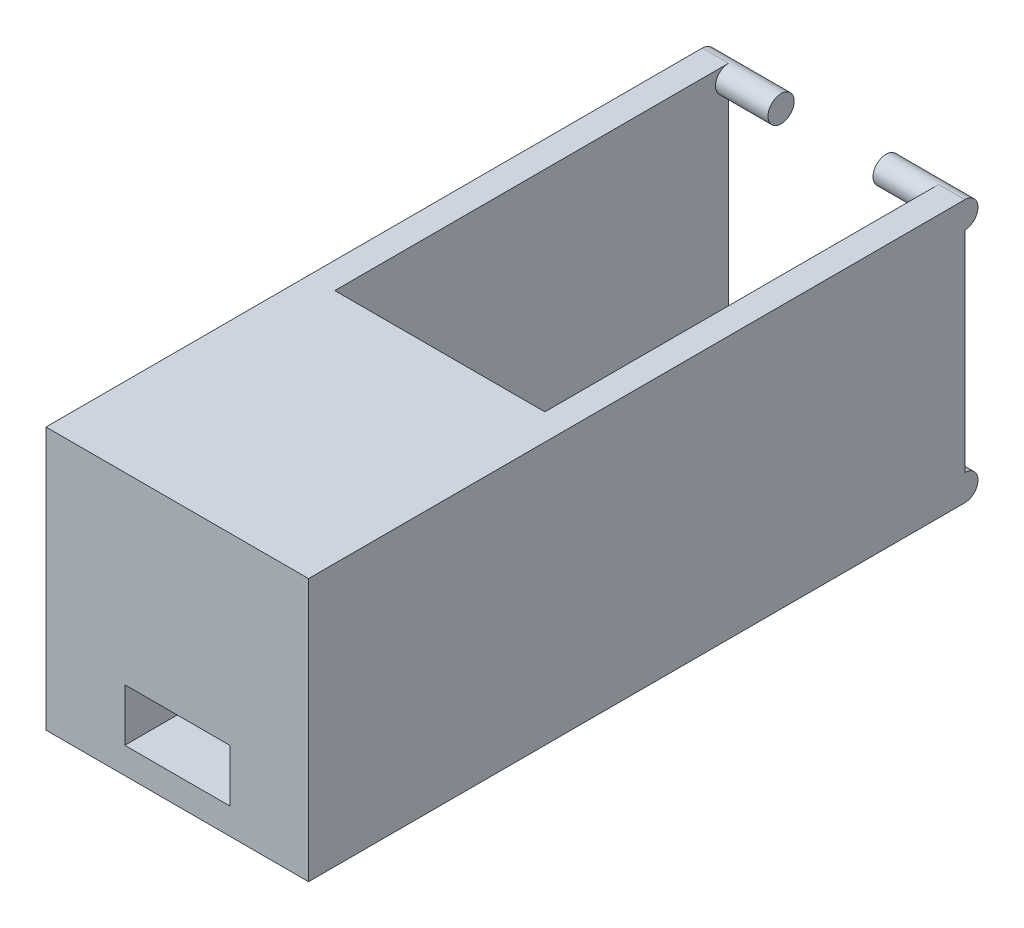
ISO-10303-21;
HEADER;
FILE_DESCRIPTION(('STEP AP214'),'2;1');
FILE_NAME('part.step','',(''),(''),'','','');
FILE_SCHEMA(('AUTOMOTIVE_DESIGN { 1 0 10303 214 1 1 1 1 }'));
ENDSEC;
DATA;
#1=APPLICATION_CONTEXT('core data for automotive mechanical design processes');
#2=APPLICATION_PROTOCOL_DEFINITION('international standard','automotive_design',2000,#1);
#3=PRODUCT_CONTEXT('',#1,'mechanical');
#4=PRODUCT('Part','Part','',(#3));
#5=PRODUCT_RELATED_PRODUCT_CATEGORY('part','',(#4));
#6=PRODUCT_DEFINITION_FORMATION('','',#4);
#7=PRODUCT_DEFINITION_CONTEXT('part definition',#1,'design');
#8=PRODUCT_DEFINITION('design','',#6,#7);
#9=PRODUCT_DEFINITION_SHAPE('','',#8);
#10=(LENGTH_UNIT() NAMED_UNIT(*) SI_UNIT(.MILLI.,.METRE.));
#11=(NAMED_UNIT(*) PLANE_ANGLE_UNIT() SI_UNIT($,.RADIAN.));
#12=(NAMED_UNIT(*) SI_UNIT($,.STERADIAN.) SOLID_ANGLE_UNIT());
#13=UNCERTAINTY_MEASURE_WITH_UNIT(LENGTH_MEASURE(1.E-05),#10,'distance_accuracy_value','');
#14=(GEOMETRIC_REPRESENTATION_CONTEXT(3) GLOBAL_UNCERTAINTY_ASSIGNED_CONTEXT((#13)) GLOBAL_UNIT_ASSIGNED_CONTEXT((#10,
#11,#12)) REPRESENTATION_CONTEXT('',''));
#15=CARTESIAN_POINT('',(0.,0.,0.));
#16=DIRECTION('',(0.,0.,1.));
#17=DIRECTION('',(1.,0.,0.));
#18=AXIS2_PLACEMENT_3D('',#15,#16,#17);
#19=CARTESIAN_POINT('',(-10.,20.,-30.));
#20=DIRECTION('',(0.,0.,1.));
#21=DIRECTION('',(1.,0.,0.));
#22=AXIS2_PLACEMENT_3D('',#19,#20,#21);
#23=PLANE('',#22);
#24=DIRECTION('',(0.,-1.,0.));
#25=VECTOR('',#24,1.);
#26=CARTESIAN_POINT('',(-10.,20.,-30.));
#27=LINE('',#26,#25);
#28=CARTESIAN_POINT('',(-10.,18.,-30.));
#29=VERTEX_POINT('',#28);
#30=CARTESIAN_POINT('',(-10.,2.,-30.));
#31=VERTEX_POINT('',#30);
#32=EDGE_CURVE('E236',#29,#31,#27,.T.);
#33=ORIENTED_EDGE('',*,*,#32,.F.);
#34=DIRECTION('',(1.,0.,0.));
#35=VECTOR('',#34,1.);
#36=CARTESIAN_POINT('',(-10.,18.,-30.));
#37=LINE('',#36,#35);
#38=CARTESIAN_POINT('',(-8.00000000000001,18.,-30.));
#39=VERTEX_POINT('',#38);
#40=EDGE_CURVE('E281',#29,#39,#37,.T.);
#41=ORIENTED_EDGE('',*,*,#40,.T.);
#42=DIRECTION('',(0.,1.,0.));
#43=VECTOR('',#42,1.);
#44=CARTESIAN_POINT('',(-8.00000000000001,2.,-30.));
#45=LINE('',#44,#43);
#46=CARTESIAN_POINT('',(-8.00000000000001,2.,-30.));
#47=VERTEX_POINT('',#46);
#48=EDGE_CURVE('E213',#47,#39,#45,.T.);
#49=ORIENTED_EDGE('',*,*,#48,.F.);
#50=DIRECTION('',(1.,0.,0.));
#51=VECTOR('',#50,1.);
#52=CARTESIAN_POINT('',(-10.,2.,-30.));
#53=LINE('',#52,#51);
#54=EDGE_CURVE('E280',#47,#31,#53,.F.);
#55=ORIENTED_EDGE('',*,*,#54,.T.);
#56=EDGE_LOOP('',(#33,#41,#49,#55));
#57=FACE_BOUND('',#56,.T.);
#58=ADVANCED_FACE('F34',(#57),#23,.F.);
#59=CARTESIAN_POINT('',(-10.,20.,-30.));
#60=DIRECTION('',(1.,0.,0.));
#61=DIRECTION('',(0.,0.,-1.));
#62=AXIS2_PLACEMENT_3D('',#59,#60,#61);
#63=PLANE('',#62);
#64=DIRECTION('',(0.,0.,1.));
#65=VECTOR('',#64,1.);
#66=CARTESIAN_POINT('',(-10.,20.,-30.));
#67=LINE('',#66,#65);
#68=CARTESIAN_POINT('',(-10.,20.,-30.));
#69=VERTEX_POINT('',#68);
#70=CARTESIAN_POINT('',(-10.,20.,20.));
#71=VERTEX_POINT('',#70);
#72=EDGE_CURVE('E223',#69,#71,#67,.T.);
#73=ORIENTED_EDGE('',*,*,#72,.F.);
#74=CARTESIAN_POINT('',(-10.,19.,-30.));
#75=DIRECTION('',(1.,0.,0.));
#76=DIRECTION('',(0.,0.,-1.));
#77=AXIS2_PLACEMENT_3D('',#74,#75,#76);
#78=CIRCLE('',#77,0.999999999999998);
#79=EDGE_CURVE('E284',#29,#69,#78,.T.);
#80=ORIENTED_EDGE('',*,*,#79,.F.);
#81=ORIENTED_EDGE('',*,*,#32,.T.);
#82=CARTESIAN_POINT('',(-10.,1.,-30.));
#83=DIRECTION('',(1.,0.,0.));
#84=DIRECTION('',(0.,0.,-1.));
#85=AXIS2_PLACEMENT_3D('',#82,#83,#84);
#86=CIRCLE('',#85,0.999999999999998);
#87=CARTESIAN_POINT('',(-10.,0.,-30.));
#88=VERTEX_POINT('',#87);
#89=EDGE_CURVE('E287',#88,#31,#86,.T.);
#90=ORIENTED_EDGE('',*,*,#89,.F.);
#91=DIRECTION('',(0.,0.,1.));
#92=VECTOR('',#91,1.);
#93=CARTESIAN_POINT('',(-10.,0.,-30.));
#94=LINE('',#93,#92);
#95=CARTESIAN_POINT('',(-10.,0.,20.));
#96=VERTEX_POINT('',#95);
#97=EDGE_CURVE('E216',#88,#96,#94,.T.);
#98=ORIENTED_EDGE('',*,*,#97,.T.);
#99=DIRECTION('',(0.,-1.,0.));
#100=VECTOR('',#99,1.);
#101=CARTESIAN_POINT('',(-10.,20.,20.));
#102=LINE('',#101,#100);
#103=EDGE_CURVE('E252',#71,#96,#102,.T.);
#104=ORIENTED_EDGE('',*,*,#103,.F.);
#105=EDGE_LOOP('',(#73,#80,#81,#90,#98,#104));
#106=FACE_BOUND('',#105,.T.);
#107=ADVANCED_FACE('F36',(#106),#63,.F.);
#108=CARTESIAN_POINT('',(-10.,20.,20.));
#109=DIRECTION('',(0.,0.,-1.));
#110=DIRECTION('',(-1.,0.,0.));
#111=AXIS2_PLACEMENT_3D('',#108,#109,#110);
#112=PLANE('',#111);
#113=DIRECTION('',(1.,0.,0.));
#114=VECTOR('',#113,1.);
#115=CARTESIAN_POINT('',(-10.,6.,20.));
#116=LINE('',#115,#114);
#117=CARTESIAN_POINT('',(-4.,6.,20.));
#118=VERTEX_POINT('',#117);
#119=CARTESIAN_POINT('',(4.,6.,20.));
#120=VERTEX_POINT('',#119);
#121=EDGE_CURVE('E395',#118,#120,#116,.T.);
#122=ORIENTED_EDGE('',*,*,#121,.T.);
#123=DIRECTION('',(0.,-1.,0.));
#124=VECTOR('',#123,1.);
#125=CARTESIAN_POINT('',(4.,20.,20.));
#126=LINE('',#125,#124);
#127=CARTESIAN_POINT('',(4.,2.,20.));
#128=VERTEX_POINT('',#127);
#129=EDGE_CURVE('E396',#120,#128,#126,.T.);
#130=ORIENTED_EDGE('',*,*,#129,.T.);
#131=DIRECTION('',(-1.,0.,0.));
#132=VECTOR('',#131,1.);
#133=CARTESIAN_POINT('',(-10.,2.,20.));
#134=LINE('',#133,#132);
#135=CARTESIAN_POINT('',(-4.,2.,20.));
#136=VERTEX_POINT('',#135);
#137=EDGE_CURVE('E401',#128,#136,#134,.T.);
#138=ORIENTED_EDGE('',*,*,#137,.T.);
#139=DIRECTION('',(0.,1.,0.));
#140=VECTOR('',#139,1.);
#141=CARTESIAN_POINT('',(-4.,20.,20.));
#142=LINE('',#141,#140);
#143=EDGE_CURVE('E171',#136,#118,#142,.T.);
#144=ORIENTED_EDGE('',*,*,#143,.T.);
#145=EDGE_LOOP('',(#122,#130,#138,#144));
#146=FACE_BOUND('',#145,.T.);
#147=DIRECTION('',(1.,0.,0.));
#148=VECTOR('',#147,1.);
#149=CARTESIAN_POINT('',(-10.,0.,20.));
#150=LINE('',#149,#148);
#151=CARTESIAN_POINT('',(10.,0.,20.));
#152=VERTEX_POINT('',#151);
#153=EDGE_CURVE('E239',#96,#152,#150,.T.);
#154=ORIENTED_EDGE('',*,*,#153,.T.);
#155=DIRECTION('',(0.,-1.,0.));
#156=VECTOR('',#155,1.);
#157=CARTESIAN_POINT('',(10.,20.,20.));
#158=LINE('',#157,#156);
#159=CARTESIAN_POINT('',(10.,20.,20.));
#160=VERTEX_POINT('',#159);
#161=EDGE_CURVE('E249',#160,#152,#158,.T.);
#162=ORIENTED_EDGE('',*,*,#161,.F.);
#163=DIRECTION('',(1.,0.,0.));
#164=VECTOR('',#163,1.);
#165=CARTESIAN_POINT('',(-10.,20.,20.));
#166=LINE('',#165,#164);
#167=EDGE_CURVE('E226',#71,#160,#166,.T.);
#168=ORIENTED_EDGE('',*,*,#167,.F.);
#169=ORIENTED_EDGE('',*,*,#103,.T.);
#170=EDGE_LOOP('',(#154,#162,#168,#169));
#171=FACE_BOUND('',#170,.T.);
#172=ADVANCED_FACE('F358',(#146,#171),#112,.F.);
#173=CARTESIAN_POINT('',(10.,20.,-30.));
#174=DIRECTION('',(-1.,0.,0.));
#175=DIRECTION('',(0.,0.,1.));
#176=AXIS2_PLACEMENT_3D('',#173,#174,#175);
#177=PLANE('',#176);
#178=DIRECTION('',(0.,-1.,0.));
#179=VECTOR('',#178,1.);
#180=CARTESIAN_POINT('',(10.,20.,-30.));
#181=LINE('',#180,#179);
#182=CARTESIAN_POINT('',(10.,18.,-30.));
#183=VERTEX_POINT('',#182);
#184=CARTESIAN_POINT('',(10.,2.,-30.));
#185=VERTEX_POINT('',#184);
#186=EDGE_CURVE('E247',#183,#185,#181,.T.);
#187=ORIENTED_EDGE('',*,*,#186,.F.);
#188=CARTESIAN_POINT('',(10.,19.,-30.));
#189=DIRECTION('',(-1.,0.,0.));
#190=DIRECTION('',(0.,0.,1.));
#191=AXIS2_PLACEMENT_3D('',#188,#189,#190);
#192=CIRCLE('',#191,0.999999999999998);
#193=CARTESIAN_POINT('',(10.,20.,-30.));
#194=VERTEX_POINT('',#193);
#195=EDGE_CURVE('E344',#194,#183,#192,.T.);
#196=ORIENTED_EDGE('',*,*,#195,.F.);
#197=DIRECTION('',(0.,0.,-1.));
#198=VECTOR('',#197,1.);
#199=CARTESIAN_POINT('',(10.,20.,-30.));
#200=LINE('',#199,#198);
#201=EDGE_CURVE('E229',#160,#194,#200,.T.);
#202=ORIENTED_EDGE('',*,*,#201,.F.);
#203=ORIENTED_EDGE('',*,*,#161,.T.);
#204=DIRECTION('',(0.,0.,-1.));
#205=VECTOR('',#204,1.);
#206=CARTESIAN_POINT('',(10.,0.,-30.));
#207=LINE('',#206,#205);
#208=CARTESIAN_POINT('',(10.,0.,-30.));
#209=VERTEX_POINT('',#208);
#210=EDGE_CURVE('E241',#152,#209,#207,.T.);
#211=ORIENTED_EDGE('',*,*,#210,.T.);
#212=CARTESIAN_POINT('',(10.,1.,-30.));
#213=DIRECTION('',(-1.,0.,0.));
#214=DIRECTION('',(0.,0.,1.));
#215=AXIS2_PLACEMENT_3D('',#212,#213,#214);
#216=CIRCLE('',#215,0.999999999999998);
#217=EDGE_CURVE('E336',#185,#209,#216,.T.);
#218=ORIENTED_EDGE('',*,*,#217,.F.);
#219=EDGE_LOOP('',(#187,#196,#202,#203,#211,#218));
#220=FACE_BOUND('',#219,.T.);
#221=ADVANCED_FACE('F353',(#220),#177,.F.);
#222=DIRECTION('',(0.,1.,0.));
#223=VECTOR('',#222,1.);
#224=CARTESIAN_POINT('',(8.,2.,-30.));
#225=LINE('',#224,#223);
#226=CARTESIAN_POINT('',(8.,2.,-30.));
#227=VERTEX_POINT('',#226);
#228=CARTESIAN_POINT('',(8.,18.,-30.));
#229=VERTEX_POINT('',#228);
#230=EDGE_CURVE('E217',#227,#229,#225,.T.);
#231=ORIENTED_EDGE('',*,*,#230,.T.);
#232=DIRECTION('',(-1.,0.,0.));
#233=VECTOR('',#232,1.);
#234=CARTESIAN_POINT('',(10.,18.,-30.));
#235=LINE('',#234,#233);
#236=EDGE_CURVE('E343',#229,#183,#235,.F.);
#237=ORIENTED_EDGE('',*,*,#236,.T.);
#238=ORIENTED_EDGE('',*,*,#186,.T.);
#239=DIRECTION('',(-1.,0.,0.));
#240=VECTOR('',#239,1.);
#241=CARTESIAN_POINT('',(10.,2.,-30.));
#242=LINE('',#241,#240);
#243=EDGE_CURVE('E329',#185,#227,#242,.T.);
#244=ORIENTED_EDGE('',*,*,#243,.T.);
#245=EDGE_LOOP('',(#231,#237,#238,#244));
#246=FACE_BOUND('',#245,.T.);
#247=ADVANCED_FACE('F333',(#246),#23,.F.);
#248=CARTESIAN_POINT('',(0.,20.,0.));
#249=DIRECTION('',(0.,1.,0.));
#250=DIRECTION('',(0.,0.,1.));
#251=AXIS2_PLACEMENT_3D('',#248,#249,#250);
#252=PLANE('',#251);
#253=DIRECTION('',(0.,0.,1.));
#254=VECTOR('',#253,1.);
#255=CARTESIAN_POINT('',(-8.00000000000001,20.,-30.));
#256=LINE('',#255,#254);
#257=CARTESIAN_POINT('',(-8.00000000000001,20.,-30.));
#258=VERTEX_POINT('',#257);
#259=CARTESIAN_POINT('',(-8.,20.,0.));
#260=VERTEX_POINT('',#259);
#261=EDGE_CURVE('E204',#258,#260,#256,.T.);
#262=ORIENTED_EDGE('',*,*,#261,.F.);
#263=DIRECTION('',(-1.,0.,0.));
#264=VECTOR('',#263,1.);
#265=CARTESIAN_POINT('',(-10.,20.,-30.));
#266=LINE('',#265,#264);
#267=EDGE_CURVE('E232',#258,#69,#266,.T.);
#268=ORIENTED_EDGE('',*,*,#267,.T.);
#269=ORIENTED_EDGE('',*,*,#72,.T.);
#270=ORIENTED_EDGE('',*,*,#167,.T.);
#271=ORIENTED_EDGE('',*,*,#201,.T.);
#272=CARTESIAN_POINT('',(8.,20.,-30.));
#273=VERTEX_POINT('',#272);
#274=EDGE_CURVE('E233',#194,#273,#266,.T.);
#275=ORIENTED_EDGE('',*,*,#274,.T.);
#276=DIRECTION('',(0.,0.,-1.));
#277=VECTOR('',#276,1.);
#278=CARTESIAN_POINT('',(8.,20.,-30.));
#279=LINE('',#278,#277);
#280=CARTESIAN_POINT('',(8.,20.,0.));
#281=VERTEX_POINT('',#280);
#282=EDGE_CURVE('E210',#281,#273,#279,.T.);
#283=ORIENTED_EDGE('',*,*,#282,.F.);
#284=DIRECTION('',(1.,0.,0.));
#285=VECTOR('',#284,1.);
#286=CARTESIAN_POINT('',(-8.,20.,0.));
#287=LINE('',#286,#285);
#288=EDGE_CURVE('E206',#260,#281,#287,.T.);
#289=ORIENTED_EDGE('',*,*,#288,.F.);
#290=EDGE_LOOP('',(#262,#268,#269,#270,#271,#275,#283,#289));
#291=FACE_BOUND('',#290,.T.);
#292=ADVANCED_FACE('F272',(#291),#252,.T.);
#293=CARTESIAN_POINT('',(0.,0.,0.));
#294=DIRECTION('',(0.,1.,0.));
#295=DIRECTION('',(0.,0.,1.));
#296=AXIS2_PLACEMENT_3D('',#293,#294,#295);
#297=PLANE('',#296);
#298=DIRECTION('',(-1.,0.,0.));
#299=VECTOR('',#298,1.);
#300=CARTESIAN_POINT('',(-10.,0.,-30.));
#301=LINE('',#300,#299);
#302=CARTESIAN_POINT('',(-4.,0.,-30.));
#303=VERTEX_POINT('',#302);
#304=EDGE_CURVE('E244',#303,#88,#301,.T.);
#305=ORIENTED_EDGE('',*,*,#304,.F.);
#306=DIRECTION('',(0.,0.,-1.));
#307=VECTOR('',#306,1.);
#308=CARTESIAN_POINT('',(-4.,0.,-42.4027351839628));
#309=LINE('',#308,#307);
#310=CARTESIAN_POINT('',(-4.,0.,-4.));
#311=VERTEX_POINT('',#310);
#312=EDGE_CURVE('E296',#311,#303,#309,.T.);
#313=ORIENTED_EDGE('',*,*,#312,.F.);
#314=DIRECTION('',(-1.,0.,0.));
#315=VECTOR('',#314,1.);
#316=CARTESIAN_POINT('',(-4.,0.,-4.));
#317=LINE('',#316,#315);
#318=CARTESIAN_POINT('',(4.,0.,-4.));
#319=VERTEX_POINT('',#318);
#320=EDGE_CURVE('E302',#319,#311,#317,.T.);
#321=ORIENTED_EDGE('',*,*,#320,.F.);
#322=DIRECTION('',(0.,0.,1.));
#323=VECTOR('',#322,1.);
#324=CARTESIAN_POINT('',(4.,0.,-42.4027351839628));
#325=LINE('',#324,#323);
#326=CARTESIAN_POINT('',(4.,0.,-30.));
#327=VERTEX_POINT('',#326);
#328=EDGE_CURVE('E299',#327,#319,#325,.T.);
#329=ORIENTED_EDGE('',*,*,#328,.F.);
#330=EDGE_CURVE('E227',#209,#327,#301,.T.);
#331=ORIENTED_EDGE('',*,*,#330,.F.);
#332=ORIENTED_EDGE('',*,*,#210,.F.);
#333=ORIENTED_EDGE('',*,*,#153,.F.);
#334=ORIENTED_EDGE('',*,*,#97,.F.);
#335=EDGE_LOOP('',(#305,#313,#321,#329,#331,#332,#333,#334));
#336=FACE_BOUND('',#335,.T.);
#337=ADVANCED_FACE('F321',(#336),#297,.F.);
#338=CARTESIAN_POINT('',(-8.00000000000001,2.,-30.));
#339=DIRECTION('',(-1.,0.,0.));
#340=DIRECTION('',(0.,0.,1.));
#341=AXIS2_PLACEMENT_3D('',#338,#339,#340);
#342=PLANE('',#341);
#343=ORIENTED_EDGE('',*,*,#48,.T.);
#344=CARTESIAN_POINT('',(-8.00000000000001,19.,-30.));
#345=DIRECTION('',(-1.,0.,0.));
#346=DIRECTION('',(0.,0.,1.));
#347=AXIS2_PLACEMENT_3D('',#344,#345,#346);
#348=CIRCLE('',#347,0.999999999999998);
#349=EDGE_CURVE('E42',#39,#258,#348,.T.);
#350=ORIENTED_EDGE('',*,*,#349,.T.);
#351=ORIENTED_EDGE('',*,*,#261,.T.);
#352=DIRECTION('',(0.,1.,0.));
#353=VECTOR('',#352,1.);
#354=CARTESIAN_POINT('',(-8.,2.,0.));
#355=LINE('',#354,#353);
#356=CARTESIAN_POINT('',(-8.,2.,0.));
#357=VERTEX_POINT('',#356);
#358=EDGE_CURVE('E203',#357,#260,#355,.T.);
#359=ORIENTED_EDGE('',*,*,#358,.F.);
#360=DIRECTION('',(0.,0.,1.));
#361=VECTOR('',#360,1.);
#362=CARTESIAN_POINT('',(-8.00000000000001,2.,-30.));
#363=LINE('',#362,#361);
#364=EDGE_CURVE('E190',#47,#357,#363,.T.);
#365=ORIENTED_EDGE('',*,*,#364,.F.);
#366=EDGE_LOOP('',(#343,#350,#351,#359,#365));
#367=FACE_BOUND('',#366,.T.);
#368=ADVANCED_FACE('F265',(#367),#342,.F.);
#369=CARTESIAN_POINT('',(8.,2.,-30.));
#370=DIRECTION('',(1.,0.,0.));
#371=DIRECTION('',(0.,0.,-1.));
#372=AXIS2_PLACEMENT_3D('',#369,#370,#371);
#373=PLANE('',#372);
#374=ORIENTED_EDGE('',*,*,#282,.T.);
#375=CARTESIAN_POINT('',(8.,19.,-30.));
#376=DIRECTION('',(1.,0.,0.));
#377=DIRECTION('',(0.,0.,-1.));
#378=AXIS2_PLACEMENT_3D('',#375,#376,#377);
#379=CIRCLE('',#378,0.999999999999998);
#380=EDGE_CURVE('E11',#273,#229,#379,.T.);
#381=ORIENTED_EDGE('',*,*,#380,.T.);
#382=ORIENTED_EDGE('',*,*,#230,.F.);
#383=DIRECTION('',(0.,0.,-1.));
#384=VECTOR('',#383,1.);
#385=CARTESIAN_POINT('',(8.,2.,-30.));
#386=LINE('',#385,#384);
#387=CARTESIAN_POINT('',(8.,2.,0.));
#388=VERTEX_POINT('',#387);
#389=EDGE_CURVE('E191',#388,#227,#386,.T.);
#390=ORIENTED_EDGE('',*,*,#389,.F.);
#391=DIRECTION('',(0.,1.,0.));
#392=VECTOR('',#391,1.);
#393=CARTESIAN_POINT('',(8.,2.,0.));
#394=LINE('',#393,#392);
#395=EDGE_CURVE('E220',#388,#281,#394,.T.);
#396=ORIENTED_EDGE('',*,*,#395,.T.);
#397=EDGE_LOOP('',(#374,#381,#382,#390,#396));
#398=FACE_BOUND('',#397,.T.);
#399=ADVANCED_FACE('F339',(#398),#373,.F.);
#400=CARTESIAN_POINT('',(-8.,2.,0.));
#401=DIRECTION('',(0.,0.,1.));
#402=DIRECTION('',(1.,0.,0.));
#403=AXIS2_PLACEMENT_3D('',#400,#401,#402);
#404=PLANE('',#403);
#405=DIRECTION('',(1.,0.,0.));
#406=VECTOR('',#405,1.);
#407=CARTESIAN_POINT('',(-8.,2.,0.));
#408=LINE('',#407,#406);
#409=CARTESIAN_POINT('',(4.,2.,0.));
#410=VERTEX_POINT('',#409);
#411=EDGE_CURVE('E192',#410,#388,#408,.T.);
#412=ORIENTED_EDGE('',*,*,#411,.F.);
#413=DIRECTION('',(0.,-1.,0.));
#414=VECTOR('',#413,1.);
#415=CARTESIAN_POINT('',(4.,2.,0.));
#416=LINE('',#415,#414);
#417=CARTESIAN_POINT('',(4.,6.,0.));
#418=VERTEX_POINT('',#417);
#419=EDGE_CURVE('E57',#418,#410,#416,.T.);
#420=ORIENTED_EDGE('',*,*,#419,.F.);
#421=DIRECTION('',(1.,0.,0.));
#422=VECTOR('',#421,1.);
#423=CARTESIAN_POINT('',(4.,6.,0.));
#424=LINE('',#423,#422);
#425=CARTESIAN_POINT('',(-4.,6.,0.));
#426=VERTEX_POINT('',#425);
#427=EDGE_CURVE('E184',#426,#418,#424,.T.);
#428=ORIENTED_EDGE('',*,*,#427,.F.);
#429=DIRECTION('',(0.,1.,0.));
#430=VECTOR('',#429,1.);
#431=CARTESIAN_POINT('',(-4.,2.,0.));
#432=LINE('',#431,#430);
#433=CARTESIAN_POINT('',(-4.,2.,0.));
#434=VERTEX_POINT('',#433);
#435=EDGE_CURVE('E168',#434,#426,#432,.T.);
#436=ORIENTED_EDGE('',*,*,#435,.F.);
#437=EDGE_CURVE('E181',#357,#434,#408,.T.);
#438=ORIENTED_EDGE('',*,*,#437,.F.);
#439=ORIENTED_EDGE('',*,*,#358,.T.);
#440=ORIENTED_EDGE('',*,*,#288,.T.);
#441=ORIENTED_EDGE('',*,*,#395,.F.);
#442=EDGE_LOOP('',(#412,#420,#428,#436,#438,#439,#440,#441));
#443=FACE_BOUND('',#442,.T.);
#444=ADVANCED_FACE('F179',(#443),#404,.F.);
#445=CARTESIAN_POINT('',(0.,2.,0.));
#446=DIRECTION('',(0.,1.,0.));
#447=DIRECTION('',(0.,0.,1.));
#448=AXIS2_PLACEMENT_3D('',#445,#446,#447);
#449=PLANE('',#448);
#450=DIRECTION('',(0.,0.,1.));
#451=VECTOR('',#450,1.);
#452=CARTESIAN_POINT('',(-4.,2.,0.));
#453=LINE('',#452,#451);
#454=CARTESIAN_POINT('',(-4.,2.,-30.));
#455=VERTEX_POINT('',#454);
#456=CARTESIAN_POINT('',(-4.,2.,-4.));
#457=VERTEX_POINT('',#456);
#458=EDGE_CURVE('E261',#455,#457,#453,.T.);
#459=ORIENTED_EDGE('',*,*,#458,.F.);
#460=DIRECTION('',(-1.,0.,0.));
#461=VECTOR('',#460,1.);
#462=CARTESIAN_POINT('',(-8.00000000000001,2.,-30.));
#463=LINE('',#462,#461);
#464=EDGE_CURVE('E195',#455,#47,#463,.T.);
#465=ORIENTED_EDGE('',*,*,#464,.T.);
#466=ORIENTED_EDGE('',*,*,#364,.T.);
#467=ORIENTED_EDGE('',*,*,#437,.T.);
#468=DIRECTION('',(0.,0.,-1.));
#469=VECTOR('',#468,1.);
#470=CARTESIAN_POINT('',(-4.,2.,30.));
#471=LINE('',#470,#469);
#472=EDGE_CURVE('E49',#136,#434,#471,.T.);
#473=ORIENTED_EDGE('',*,*,#472,.F.);
#474=ORIENTED_EDGE('',*,*,#137,.F.);
#475=DIRECTION('',(0.,0.,-1.));
#476=VECTOR('',#475,1.);
#477=CARTESIAN_POINT('',(4.,2.,30.));
#478=LINE('',#477,#476);
#479=EDGE_CURVE('E174',#128,#410,#478,.T.);
#480=ORIENTED_EDGE('',*,*,#479,.T.);
#481=ORIENTED_EDGE('',*,*,#411,.T.);
#482=ORIENTED_EDGE('',*,*,#389,.T.);
#483=CARTESIAN_POINT('',(4.,2.,-30.));
#484=VERTEX_POINT('',#483);
#485=EDGE_CURVE('E200',#227,#484,#463,.T.);
#486=ORIENTED_EDGE('',*,*,#485,.T.);
#487=DIRECTION('',(0.,0.,-1.));
#488=VECTOR('',#487,1.);
#489=CARTESIAN_POINT('',(4.,2.,0.));
#490=LINE('',#489,#488);
#491=CARTESIAN_POINT('',(4.,2.,-4.));
#492=VERTEX_POINT('',#491);
#493=EDGE_CURVE('E255',#492,#484,#490,.T.);
#494=ORIENTED_EDGE('',*,*,#493,.F.);
#495=DIRECTION('',(1.,0.,0.));
#496=VECTOR('',#495,1.);
#497=CARTESIAN_POINT('',(0.,2.,-4.));
#498=LINE('',#497,#496);
#499=EDGE_CURVE('E258',#457,#492,#498,.T.);
#500=ORIENTED_EDGE('',*,*,#499,.F.);
#501=EDGE_LOOP('',(#459,#465,#466,#467,#473,#474,#480,#481,#482,#486,#494,#500));
#502=FACE_BOUND('',#501,.T.);
#503=ADVANCED_FACE('F187',(#502),#449,.T.);
#504=CARTESIAN_POINT('',(-4.,18.,-42.4027351839628));
#505=DIRECTION('',(-1.,0.,0.));
#506=DIRECTION('',(0.,0.,1.));
#507=AXIS2_PLACEMENT_3D('',#504,#505,#506);
#508=PLANE('',#507);
#509=ORIENTED_EDGE('',*,*,#312,.T.);
#510=CARTESIAN_POINT('',(-4.,1.,-30.));
#511=DIRECTION('',(1.,0.,0.));
#512=DIRECTION('',(0.,0.,-1.));
#513=AXIS2_PLACEMENT_3D('',#510,#511,#512);
#514=CIRCLE('',#513,0.999999999999998);
#515=EDGE_CURVE('E283',#303,#455,#514,.T.);
#516=ORIENTED_EDGE('',*,*,#515,.T.);
#517=ORIENTED_EDGE('',*,*,#458,.T.);
#518=DIRECTION('',(0.,-1.,0.));
#519=VECTOR('',#518,1.);
#520=CARTESIAN_POINT('',(-4.,18.,-4.));
#521=LINE('',#520,#519);
#522=EDGE_CURVE('E207',#457,#311,#521,.T.);
#523=ORIENTED_EDGE('',*,*,#522,.T.);
#524=EDGE_LOOP('',(#509,#516,#517,#523));
#525=FACE_BOUND('',#524,.T.);
#526=ADVANCED_FACE('F324',(#525),#508,.F.);
#527=CARTESIAN_POINT('',(4.,18.,-42.4027351839628));
#528=DIRECTION('',(1.,0.,0.));
#529=DIRECTION('',(0.,0.,-1.));
#530=AXIS2_PLACEMENT_3D('',#527,#528,#529);
#531=PLANE('',#530);
#532=ORIENTED_EDGE('',*,*,#493,.T.);
#533=CARTESIAN_POINT('',(4.,1.,-30.));
#534=DIRECTION('',(-1.,0.,0.));
#535=DIRECTION('',(0.,0.,1.));
#536=AXIS2_PLACEMENT_3D('',#533,#534,#535);
#537=CIRCLE('',#536,0.999999999999998);
#538=EDGE_CURVE('E317',#484,#327,#537,.T.);
#539=ORIENTED_EDGE('',*,*,#538,.T.);
#540=ORIENTED_EDGE('',*,*,#328,.T.);
#541=DIRECTION('',(0.,-1.,0.));
#542=VECTOR('',#541,1.);
#543=CARTESIAN_POINT('',(4.,18.,-4.));
#544=LINE('',#543,#542);
#545=EDGE_CURVE('E305',#492,#319,#544,.T.);
#546=ORIENTED_EDGE('',*,*,#545,.F.);
#547=EDGE_LOOP('',(#532,#539,#540,#546));
#548=FACE_BOUND('',#547,.T.);
#549=ADVANCED_FACE('F316',(#548),#531,.F.);
#550=CARTESIAN_POINT('',(-4.,18.,-4.));
#551=DIRECTION('',(0.,0.,1.));
#552=DIRECTION('',(1.,0.,0.));
#553=AXIS2_PLACEMENT_3D('',#550,#551,#552);
#554=PLANE('',#553);
#555=ORIENTED_EDGE('',*,*,#499,.T.);
#556=ORIENTED_EDGE('',*,*,#545,.T.);
#557=ORIENTED_EDGE('',*,*,#320,.T.);
#558=ORIENTED_EDGE('',*,*,#522,.F.);
#559=EDGE_LOOP('',(#555,#556,#557,#558));
#560=FACE_BOUND('',#559,.T.);
#561=ADVANCED_FACE('F307',(#560),#554,.F.);
#562=CARTESIAN_POINT('',(-10.,1.,-30.));
#563=DIRECTION('',(1.,0.,0.));
#564=DIRECTION('',(0.,0.,-1.));
#565=AXIS2_PLACEMENT_3D('',#562,#563,#564);
#566=CYLINDRICAL_SURFACE('',#565,0.999999999999998);
#567=ORIENTED_EDGE('',*,*,#304,.T.);
#568=ORIENTED_EDGE('',*,*,#89,.T.);
#569=ORIENTED_EDGE('',*,*,#54,.F.);
#570=ORIENTED_EDGE('',*,*,#464,.F.);
#571=ORIENTED_EDGE('',*,*,#515,.F.);
#572=EDGE_LOOP('',(#567,#568,#569,#570,#571));
#573=FACE_BOUND('',#572,.T.);
#574=ADVANCED_FACE('F362',(#573),#566,.T.);
#575=CARTESIAN_POINT('',(-10.,19.,-30.));
#576=DIRECTION('',(1.,0.,0.));
#577=DIRECTION('',(0.,0.,-1.));
#578=AXIS2_PLACEMENT_3D('',#575,#576,#577);
#579=CYLINDRICAL_SURFACE('',#578,0.999999999999998);
#580=CARTESIAN_POINT('',(-4.,19.,-30.));
#581=DIRECTION('',(1.,0.,0.));
#582=DIRECTION('',(0.,0.,-1.));
#583=AXIS2_PLACEMENT_3D('',#580,#581,#582);
#584=CIRCLE('',#583,0.999999999999998);
#585=CARTESIAN_POINT('',(-4.,19.,-31.));
#586=VERTEX_POINT('',#585);
#587=EDGE_CURVE('E289',#586,#586,#584,.T.);
#588=ORIENTED_EDGE('',*,*,#587,.F.);
#589=EDGE_LOOP('',(#588));
#590=FACE_BOUND('',#589,.T.);
#591=ORIENTED_EDGE('',*,*,#40,.F.);
#592=ORIENTED_EDGE('',*,*,#79,.T.);
#593=ORIENTED_EDGE('',*,*,#267,.F.);
#594=ORIENTED_EDGE('',*,*,#349,.F.);
#595=EDGE_LOOP('',(#591,#592,#593,#594));
#596=FACE_BOUND('',#595,.T.);
#597=ADVANCED_FACE('F364',(#590,#596),#579,.T.);
#598=CARTESIAN_POINT('',(-4.,19.,-30.));
#599=DIRECTION('',(1.,0.,0.));
#600=DIRECTION('',(0.,0.,-1.));
#601=AXIS2_PLACEMENT_3D('',#598,#599,#600);
#602=PLANE('',#601);
#603=ORIENTED_EDGE('',*,*,#587,.T.);
#604=EDGE_LOOP('',(#603));
#605=FACE_BOUND('',#604,.T.);
#606=ADVANCED_FACE('F370',(#605),#602,.T.);
#607=CARTESIAN_POINT('',(10.,1.,-30.));
#608=DIRECTION('',(-1.,0.,0.));
#609=DIRECTION('',(0.,0.,1.));
#610=AXIS2_PLACEMENT_3D('',#607,#608,#609);
#611=CYLINDRICAL_SURFACE('',#610,0.999999999999998);
#612=ORIENTED_EDGE('',*,*,#217,.T.);
#613=ORIENTED_EDGE('',*,*,#330,.T.);
#614=ORIENTED_EDGE('',*,*,#538,.F.);
#615=ORIENTED_EDGE('',*,*,#485,.F.);
#616=ORIENTED_EDGE('',*,*,#243,.F.);
#617=EDGE_LOOP('',(#612,#613,#614,#615,#616));
#618=FACE_BOUND('',#617,.T.);
#619=ADVANCED_FACE('F328',(#618),#611,.T.);
#620=CARTESIAN_POINT('',(10.,19.,-30.));
#621=DIRECTION('',(-1.,0.,0.));
#622=DIRECTION('',(0.,0.,1.));
#623=AXIS2_PLACEMENT_3D('',#620,#621,#622);
#624=CYLINDRICAL_SURFACE('',#623,0.999999999999998);
#625=CARTESIAN_POINT('',(4.,19.,-30.));
#626=DIRECTION('',(-1.,0.,0.));
#627=DIRECTION('',(0.,0.,1.));
#628=AXIS2_PLACEMENT_3D('',#625,#626,#627);
#629=CIRCLE('',#628,0.999999999999998);
#630=CARTESIAN_POINT('',(4.,19.,-29.));
#631=VERTEX_POINT('',#630);
#632=EDGE_CURVE('E347',#631,#631,#629,.T.);
#633=ORIENTED_EDGE('',*,*,#632,.F.);
#634=EDGE_LOOP('',(#633));
#635=FACE_BOUND('',#634,.T.);
#636=ORIENTED_EDGE('',*,*,#236,.F.);
#637=ORIENTED_EDGE('',*,*,#380,.F.);
#638=ORIENTED_EDGE('',*,*,#274,.F.);
#639=ORIENTED_EDGE('',*,*,#195,.T.);
#640=EDGE_LOOP('',(#636,#637,#638,#639));
#641=FACE_BOUND('',#640,.T.);
#642=ADVANCED_FACE('F341',(#635,#641),#624,.T.);
#643=CARTESIAN_POINT('',(4.,19.,-30.));
#644=DIRECTION('',(-1.,0.,0.));
#645=DIRECTION('',(0.,0.,1.));
#646=AXIS2_PLACEMENT_3D('',#643,#644,#645);
#647=PLANE('',#646);
#648=ORIENTED_EDGE('',*,*,#632,.T.);
#649=EDGE_LOOP('',(#648));
#650=FACE_BOUND('',#649,.T.);
#651=ADVANCED_FACE('F413',(#650),#647,.T.);
#652=CARTESIAN_POINT('',(4.,2.,30.));
#653=DIRECTION('',(1.,0.,0.));
#654=DIRECTION('',(0.,0.,-1.));
#655=AXIS2_PLACEMENT_3D('',#652,#653,#654);
#656=PLANE('',#655);
#657=DIRECTION('',(0.,0.,-1.));
#658=VECTOR('',#657,1.);
#659=CARTESIAN_POINT('',(4.,6.,30.));
#660=LINE('',#659,#658);
#661=EDGE_CURVE('E405',#120,#418,#660,.T.);
#662=ORIENTED_EDGE('',*,*,#661,.T.);
#663=ORIENTED_EDGE('',*,*,#419,.T.);
#664=ORIENTED_EDGE('',*,*,#479,.F.);
#665=ORIENTED_EDGE('',*,*,#129,.F.);
#666=EDGE_LOOP('',(#662,#663,#664,#665));
#667=FACE_BOUND('',#666,.T.);
#668=ADVANCED_FACE('F411',(#667),#656,.F.);
#669=CARTESIAN_POINT('',(4.,6.,30.));
#670=DIRECTION('',(0.,1.,0.));
#671=DIRECTION('',(0.,0.,1.));
#672=AXIS2_PLACEMENT_3D('',#669,#670,#671);
#673=PLANE('',#672);
#674=DIRECTION('',(0.,0.,-1.));
#675=VECTOR('',#674,1.);
#676=CARTESIAN_POINT('',(-4.,6.,30.));
#677=LINE('',#676,#675);
#678=EDGE_CURVE('E173',#118,#426,#677,.T.);
#679=ORIENTED_EDGE('',*,*,#678,.T.);
#680=ORIENTED_EDGE('',*,*,#427,.T.);
#681=ORIENTED_EDGE('',*,*,#661,.F.);
#682=ORIENTED_EDGE('',*,*,#121,.F.);
#683=EDGE_LOOP('',(#679,#680,#681,#682));
#684=FACE_BOUND('',#683,.T.);
#685=ADVANCED_FACE('F410',(#684),#673,.F.);
#686=CARTESIAN_POINT('',(-4.,2.,30.));
#687=DIRECTION('',(-1.,0.,0.));
#688=DIRECTION('',(0.,0.,1.));
#689=AXIS2_PLACEMENT_3D('',#686,#687,#688);
#690=PLANE('',#689);
#691=ORIENTED_EDGE('',*,*,#472,.T.);
#692=ORIENTED_EDGE('',*,*,#435,.T.);
#693=ORIENTED_EDGE('',*,*,#678,.F.);
#694=ORIENTED_EDGE('',*,*,#143,.F.);
#695=EDGE_LOOP('',(#691,#692,#693,#694));
#696=FACE_BOUND('',#695,.T.);
#697=ADVANCED_FACE('F166',(#696),#690,.F.);
#698=CLOSED_SHELL('',(#58,#107,#172,#221,#247,#292,#337,#368,#399,#444,#503,#526,#549,#561,#574,
#597,#606,#619,#642,#651,#668,#685,#697));
#699=MANIFOLD_SOLID_BREP('B2',#698);
#700=ADVANCED_BREP_SHAPE_REPRESENTATION('',(#18,#699),#14);
#701=SHAPE_DEFINITION_REPRESENTATION(#9,#700);
ENDSEC;
END-ISO-10303-21;
